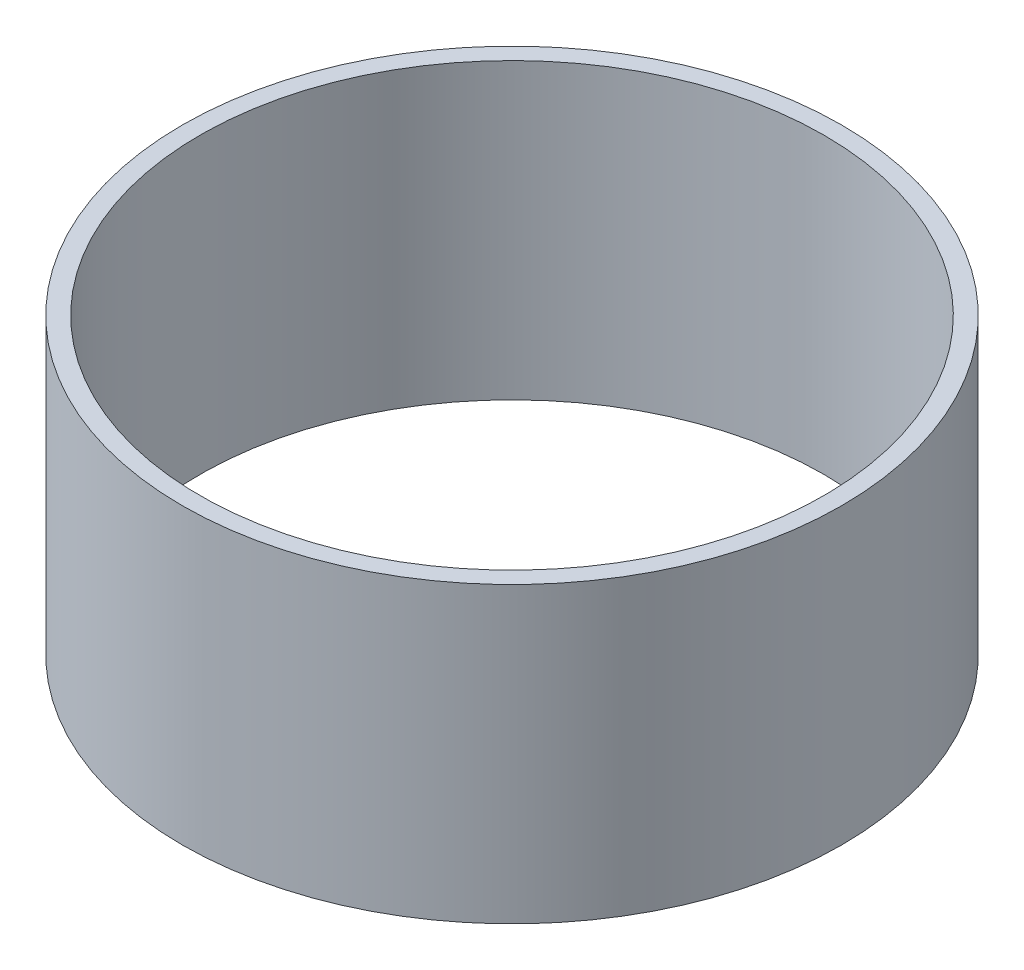
ISO-10303-21;
HEADER;
FILE_DESCRIPTION(('STEP AP214'),'2;1');
FILE_NAME('part.step','',(''),(''),'','','');
FILE_SCHEMA(('AUTOMOTIVE_DESIGN { 1 0 10303 214 1 1 1 1 }'));
ENDSEC;
DATA;
#1=APPLICATION_CONTEXT('core data for automotive mechanical design processes');
#2=APPLICATION_PROTOCOL_DEFINITION('international standard','automotive_design',2000,#1);
#3=PRODUCT_CONTEXT('',#1,'mechanical');
#4=PRODUCT('Part','Part','',(#3));
#5=PRODUCT_RELATED_PRODUCT_CATEGORY('part','',(#4));
#6=PRODUCT_DEFINITION_FORMATION('','',#4);
#7=PRODUCT_DEFINITION_CONTEXT('part definition',#1,'design');
#8=PRODUCT_DEFINITION('design','',#6,#7);
#9=PRODUCT_DEFINITION_SHAPE('','',#8);
#10=(LENGTH_UNIT() NAMED_UNIT(*) SI_UNIT(.MILLI.,.METRE.));
#11=(NAMED_UNIT(*) PLANE_ANGLE_UNIT() SI_UNIT($,.RADIAN.));
#12=(NAMED_UNIT(*) SI_UNIT($,.STERADIAN.) SOLID_ANGLE_UNIT());
#13=UNCERTAINTY_MEASURE_WITH_UNIT(LENGTH_MEASURE(1.E-05),#10,'distance_accuracy_value','');
#14=(GEOMETRIC_REPRESENTATION_CONTEXT(3) GLOBAL_UNCERTAINTY_ASSIGNED_CONTEXT((#13)) GLOBAL_UNIT_ASSIGNED_CONTEXT((#10,
#11,#12)) REPRESENTATION_CONTEXT('',''));
#15=CARTESIAN_POINT('',(0.,0.,0.));
#16=DIRECTION('',(0.,0.,1.));
#17=DIRECTION('',(1.,0.,0.));
#18=AXIS2_PLACEMENT_3D('',#15,#16,#17);
#19=CARTESIAN_POINT('',(0.,-13.97,0.));
#20=DIRECTION('',(0.,-1.,0.));
#21=DIRECTION('',(0.,0.,-1.));
#22=AXIS2_PLACEMENT_3D('',#19,#20,#21);
#23=CYLINDRICAL_SURFACE('',#22,26.9748);
#24=CARTESIAN_POINT('',(0.,0.,0.));
#25=DIRECTION('',(0.,-1.,0.));
#26=DIRECTION('',(0.,0.,-1.));
#27=AXIS2_PLACEMENT_3D('',#24,#25,#26);
#28=CIRCLE('',#27,26.9748);
#29=CARTESIAN_POINT('',(0.,0.,-26.9748));
#30=VERTEX_POINT('',#29);
#31=EDGE_CURVE('E50',#30,#30,#28,.T.);
#32=ORIENTED_EDGE('',*,*,#31,.T.);
#33=EDGE_LOOP('',(#32));
#34=FACE_BOUND('',#33,.T.);
#35=CARTESIAN_POINT('',(0.,25.4,0.));
#36=DIRECTION('',(0.,-1.,0.));
#37=DIRECTION('',(0.,0.,-1.));
#38=AXIS2_PLACEMENT_3D('',#35,#36,#37);
#39=CIRCLE('',#38,26.9748);
#40=CARTESIAN_POINT('',(0.,25.4,-26.9748));
#41=VERTEX_POINT('',#40);
#42=EDGE_CURVE('E10',#41,#41,#39,.T.);
#43=ORIENTED_EDGE('',*,*,#42,.F.);
#44=EDGE_LOOP('',(#43));
#45=FACE_BOUND('',#44,.T.);
#46=ADVANCED_FACE('F36',(#34,#45),#23,.F.);
#47=CARTESIAN_POINT('',(26.9748,25.4,0.));
#48=DIRECTION('',(0.,1.,0.));
#49=DIRECTION('',(0.,0.,1.));
#50=AXIS2_PLACEMENT_3D('',#47,#48,#49);
#51=PLANE('',#50);
#52=ORIENTED_EDGE('',*,*,#42,.T.);
#53=EDGE_LOOP('',(#52));
#54=FACE_BOUND('',#53,.T.);
#55=CARTESIAN_POINT('',(0.,25.4,0.));
#56=DIRECTION('',(0.,-1.,0.));
#57=DIRECTION('',(0.,0.,-1.));
#58=AXIS2_PLACEMENT_3D('',#55,#56,#57);
#59=CIRCLE('',#58,28.4988);
#60=CARTESIAN_POINT('',(0.,25.4,-28.4988));
#61=VERTEX_POINT('',#60);
#62=EDGE_CURVE('E42',#61,#61,#59,.T.);
#63=ORIENTED_EDGE('',*,*,#62,.F.);
#64=EDGE_LOOP('',(#63));
#65=FACE_BOUND('',#64,.T.);
#66=ADVANCED_FACE('F66',(#54,#65),#51,.T.);
#67=CARTESIAN_POINT('',(0.,-13.97,0.));
#68=DIRECTION('',(0.,-1.,0.));
#69=DIRECTION('',(0.,0.,-1.));
#70=AXIS2_PLACEMENT_3D('',#67,#68,#69);
#71=CYLINDRICAL_SURFACE('',#70,28.4988);
#72=ORIENTED_EDGE('',*,*,#62,.T.);
#73=EDGE_LOOP('',(#72));
#74=FACE_BOUND('',#73,.T.);
#75=CARTESIAN_POINT('',(0.,0.,0.));
#76=DIRECTION('',(0.,-1.,0.));
#77=DIRECTION('',(0.,0.,-1.));
#78=AXIS2_PLACEMENT_3D('',#75,#76,#77);
#79=CIRCLE('',#78,28.4988);
#80=CARTESIAN_POINT('',(0.,0.,-28.4988));
#81=VERTEX_POINT('',#80);
#82=EDGE_CURVE('E46',#81,#81,#79,.T.);
#83=ORIENTED_EDGE('',*,*,#82,.F.);
#84=EDGE_LOOP('',(#83));
#85=FACE_BOUND('',#84,.T.);
#86=ADVANCED_FACE('F60',(#74,#85),#71,.T.);
#87=CARTESIAN_POINT('',(26.9748,0.,0.));
#88=DIRECTION('',(0.,-1.,0.));
#89=DIRECTION('',(0.,0.,-1.));
#90=AXIS2_PLACEMENT_3D('',#87,#88,#89);
#91=PLANE('',#90);
#92=ORIENTED_EDGE('',*,*,#82,.T.);
#93=EDGE_LOOP('',(#92));
#94=FACE_BOUND('',#93,.T.);
#95=ORIENTED_EDGE('',*,*,#31,.F.);
#96=EDGE_LOOP('',(#95));
#97=FACE_BOUND('',#96,.T.);
#98=ADVANCED_FACE('F58',(#94,#97),#91,.T.);
#99=CLOSED_SHELL('',(#46,#66,#86,#98));
#100=MANIFOLD_SOLID_BREP('B2',#99);
#101=ADVANCED_BREP_SHAPE_REPRESENTATION('',(#18,#100),#14);
#102=SHAPE_DEFINITION_REPRESENTATION(#9,#101);
ENDSEC;
END-ISO-10303-21;
